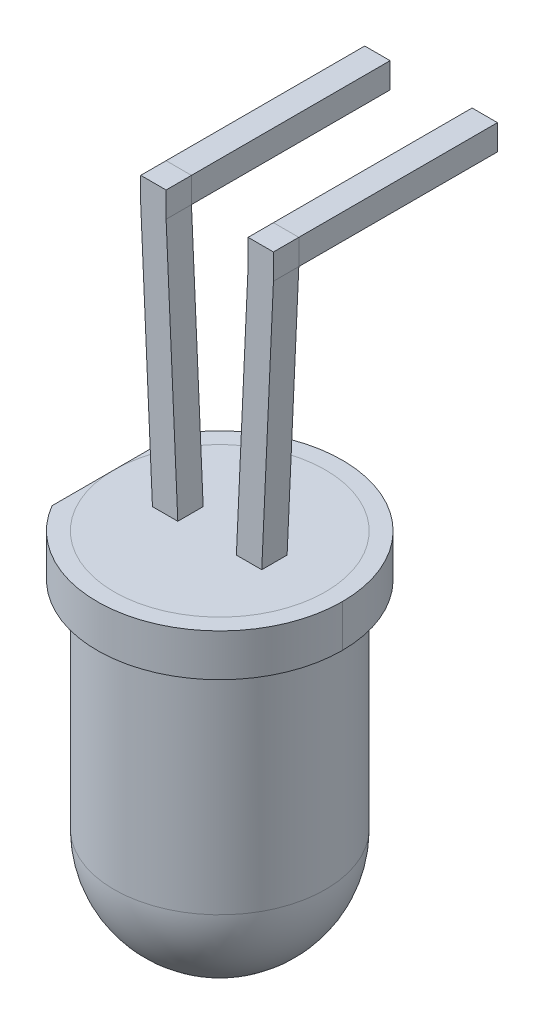
ISO-10303-21;
HEADER;
FILE_DESCRIPTION(('STEP AP214'),'2;1');
FILE_NAME('part.step','',(''),(''),'','','');
FILE_SCHEMA(('AUTOMOTIVE_DESIGN { 1 0 10303 214 1 1 1 1 }'));
ENDSEC;
DATA;
#1=APPLICATION_CONTEXT('core data for automotive mechanical design processes');
#2=APPLICATION_PROTOCOL_DEFINITION('international standard','automotive_design',2000,#1);
#3=PRODUCT_CONTEXT('',#1,'mechanical');
#4=PRODUCT('Part','Part','',(#3));
#5=PRODUCT_RELATED_PRODUCT_CATEGORY('part','',(#4));
#6=PRODUCT_DEFINITION_FORMATION('','',#4);
#7=PRODUCT_DEFINITION_CONTEXT('part definition',#1,'design');
#8=PRODUCT_DEFINITION('design','',#6,#7);
#9=PRODUCT_DEFINITION_SHAPE('','',#8);
#10=(LENGTH_UNIT() NAMED_UNIT(*) SI_UNIT(.MILLI.,.METRE.));
#11=(NAMED_UNIT(*) PLANE_ANGLE_UNIT() SI_UNIT($,.RADIAN.));
#12=(NAMED_UNIT(*) SI_UNIT($,.STERADIAN.) SOLID_ANGLE_UNIT());
#13=UNCERTAINTY_MEASURE_WITH_UNIT(LENGTH_MEASURE(1.E-05),#10,'distance_accuracy_value','');
#14=(GEOMETRIC_REPRESENTATION_CONTEXT(3) GLOBAL_UNCERTAINTY_ASSIGNED_CONTEXT((#13)) GLOBAL_UNIT_ASSIGNED_CONTEXT((#10,
#11,#12)) REPRESENTATION_CONTEXT('',''));
#15=CARTESIAN_POINT('',(0.,0.,0.));
#16=DIRECTION('',(0.,0.,1.));
#17=DIRECTION('',(1.,0.,0.));
#18=AXIS2_PLACEMENT_3D('',#15,#16,#17);
#19=CARTESIAN_POINT('',(2.84,0.3,-2.));
#20=DIRECTION('',(0.,0.,-1.));
#21=DIRECTION('',(0.,-1.,0.));
#22=AXIS2_PLACEMENT_3D('',#19,#20,#21);
#23=PLANE('',#22);
#24=DIRECTION('',(0.,1.,0.));
#25=VECTOR('',#24,1.);
#26=CARTESIAN_POINT('',(2.84,-0.3,-2.));
#27=LINE('',#26,#25);
#28=CARTESIAN_POINT('',(2.84,-0.3,-2.));
#29=VERTEX_POINT('',#28);
#30=CARTESIAN_POINT('',(2.84,0.3,-2.));
#31=VERTEX_POINT('',#30);
#32=EDGE_CURVE('E11',#29,#31,#27,.T.);
#33=ORIENTED_EDGE('',*,*,#32,.F.);
#34=DIRECTION('',(1.,0.,0.));
#35=VECTOR('',#34,1.);
#36=CARTESIAN_POINT('',(2.24,-0.3,-2.));
#37=LINE('',#36,#35);
#38=CARTESIAN_POINT('',(2.24,-0.3,-2.));
#39=VERTEX_POINT('',#38);
#40=EDGE_CURVE('E342',#39,#29,#37,.T.);
#41=ORIENTED_EDGE('',*,*,#40,.F.);
#42=DIRECTION('',(0.,-1.,0.));
#43=VECTOR('',#42,1.);
#44=CARTESIAN_POINT('',(2.24,0.3,-2.));
#45=LINE('',#44,#43);
#46=CARTESIAN_POINT('',(2.24,0.3,-2.));
#47=VERTEX_POINT('',#46);
#48=EDGE_CURVE('E26',#47,#39,#45,.T.);
#49=ORIENTED_EDGE('',*,*,#48,.F.);
#50=DIRECTION('',(-1.,0.,0.));
#51=VECTOR('',#50,1.);
#52=CARTESIAN_POINT('',(2.84,0.3,-2.));
#53=LINE('',#52,#51);
#54=EDGE_CURVE('E359',#31,#47,#53,.T.);
#55=ORIENTED_EDGE('',*,*,#54,.F.);
#56=EDGE_LOOP('',(#33,#41,#49,#55));
#57=FACE_BOUND('',#56,.T.);
#58=ADVANCED_FACE('F18',(#57),#23,.T.);
#59=CARTESIAN_POINT('',(2.84,-0.3,-2.));
#60=DIRECTION('',(-1.,0.,0.));
#61=DIRECTION('',(0.,0.,1.));
#62=AXIS2_PLACEMENT_3D('',#59,#60,#61);
#63=PLANE('',#62);
#64=ORIENTED_EDGE('',*,*,#32,.T.);
#65=DIRECTION('',(0.,0.,1.));
#66=VECTOR('',#65,1.);
#67=CARTESIAN_POINT('',(2.84,0.3,-2.));
#68=LINE('',#67,#66);
#69=CARTESIAN_POINT('',(2.84,0.3,2.7));
#70=VERTEX_POINT('',#69);
#71=EDGE_CURVE('E366',#31,#70,#68,.T.);
#72=ORIENTED_EDGE('',*,*,#71,.T.);
#73=DIRECTION('',(0.,-1.,0.));
#74=VECTOR('',#73,1.);
#75=CARTESIAN_POINT('',(2.84,0.3,2.7));
#76=LINE('',#75,#74);
#77=CARTESIAN_POINT('',(2.84,-0.3,2.7));
#78=VERTEX_POINT('',#77);
#79=EDGE_CURVE('E338',#70,#78,#76,.T.);
#80=ORIENTED_EDGE('',*,*,#79,.T.);
#81=DIRECTION('',(0.,0.,1.));
#82=VECTOR('',#81,1.);
#83=CARTESIAN_POINT('',(2.84,-0.3,-2.));
#84=LINE('',#83,#82);
#85=EDGE_CURVE('E346',#29,#78,#84,.T.);
#86=ORIENTED_EDGE('',*,*,#85,.F.);
#87=EDGE_LOOP('',(#64,#72,#80,#86));
#88=FACE_BOUND('',#87,.T.);
#89=ADVANCED_FACE('F378',(#88),#63,.F.);
#90=CARTESIAN_POINT('',(2.24,0.3,-2.));
#91=DIRECTION('',(1.,0.,0.));
#92=DIRECTION('',(0.,1.,0.));
#93=AXIS2_PLACEMENT_3D('',#90,#91,#92);
#94=PLANE('',#93);
#95=ORIENTED_EDGE('',*,*,#48,.T.);
#96=DIRECTION('',(0.,0.,1.));
#97=VECTOR('',#96,1.);
#98=CARTESIAN_POINT('',(2.24,-0.3,-2.));
#99=LINE('',#98,#97);
#100=CARTESIAN_POINT('',(2.24,-0.3,2.7));
#101=VERTEX_POINT('',#100);
#102=EDGE_CURVE('E349',#39,#101,#99,.T.);
#103=ORIENTED_EDGE('',*,*,#102,.T.);
#104=DIRECTION('',(0.,-1.,0.));
#105=VECTOR('',#104,1.);
#106=CARTESIAN_POINT('',(2.24,0.3,2.7));
#107=LINE('',#106,#105);
#108=CARTESIAN_POINT('',(2.24,0.3,2.7));
#109=VERTEX_POINT('',#108);
#110=EDGE_CURVE('E334',#109,#101,#107,.T.);
#111=ORIENTED_EDGE('',*,*,#110,.F.);
#112=DIRECTION('',(0.,0.,1.));
#113=VECTOR('',#112,1.);
#114=CARTESIAN_POINT('',(2.24,0.3,-2.));
#115=LINE('',#114,#113);
#116=EDGE_CURVE('E363',#47,#109,#115,.T.);
#117=ORIENTED_EDGE('',*,*,#116,.F.);
#118=EDGE_LOOP('',(#95,#103,#111,#117));
#119=FACE_BOUND('',#118,.T.);
#120=ADVANCED_FACE('F372',(#119),#94,.F.);
#121=CARTESIAN_POINT('',(2.84,0.3,-2.));
#122=DIRECTION('',(0.,-1.,0.));
#123=DIRECTION('',(0.,0.,-1.));
#124=AXIS2_PLACEMENT_3D('',#121,#122,#123);
#125=PLANE('',#124);
#126=ORIENTED_EDGE('',*,*,#54,.T.);
#127=ORIENTED_EDGE('',*,*,#116,.T.);
#128=DIRECTION('',(-1.,0.,0.));
#129=VECTOR('',#128,1.);
#130=CARTESIAN_POINT('',(2.84,0.3,2.7));
#131=LINE('',#130,#129);
#132=EDGE_CURVE('E301',#70,#109,#131,.T.);
#133=ORIENTED_EDGE('',*,*,#132,.F.);
#134=ORIENTED_EDGE('',*,*,#71,.F.);
#135=EDGE_LOOP('',(#126,#127,#133,#134));
#136=FACE_BOUND('',#135,.T.);
#137=ADVANCED_FACE('F537',(#136),#125,.F.);
#138=CARTESIAN_POINT('',(0.3,0.3,-2.));
#139=DIRECTION('',(0.,0.,-1.));
#140=DIRECTION('',(0.,-1.,0.));
#141=AXIS2_PLACEMENT_3D('',#138,#139,#140);
#142=PLANE('',#141);
#143=DIRECTION('',(0.,1.,0.));
#144=VECTOR('',#143,1.);
#145=CARTESIAN_POINT('',(0.3,-0.3,-2.));
#146=LINE('',#145,#144);
#147=CARTESIAN_POINT('',(0.3,-0.3,-2.));
#148=VERTEX_POINT('',#147);
#149=CARTESIAN_POINT('',(0.3,0.3,-2.));
#150=VERTEX_POINT('',#149);
#151=EDGE_CURVE('E356',#148,#150,#146,.T.);
#152=ORIENTED_EDGE('',*,*,#151,.F.);
#153=DIRECTION('',(1.,0.,0.));
#154=VECTOR('',#153,1.);
#155=CARTESIAN_POINT('',(-0.3,-0.3,-2.));
#156=LINE('',#155,#154);
#157=CARTESIAN_POINT('',(-0.3,-0.3,-2.));
#158=VERTEX_POINT('',#157);
#159=EDGE_CURVE('E232',#158,#148,#156,.T.);
#160=ORIENTED_EDGE('',*,*,#159,.F.);
#161=DIRECTION('',(0.,-1.,0.));
#162=VECTOR('',#161,1.);
#163=CARTESIAN_POINT('',(-0.3,0.3,-2.));
#164=LINE('',#163,#162);
#165=CARTESIAN_POINT('',(-0.3,0.3,-2.));
#166=VERTEX_POINT('',#165);
#167=EDGE_CURVE('E352',#166,#158,#164,.T.);
#168=ORIENTED_EDGE('',*,*,#167,.F.);
#169=DIRECTION('',(-1.,0.,0.));
#170=VECTOR('',#169,1.);
#171=CARTESIAN_POINT('',(0.3,0.3,-2.));
#172=LINE('',#171,#170);
#173=EDGE_CURVE('E355',#150,#166,#172,.T.);
#174=ORIENTED_EDGE('',*,*,#173,.F.);
#175=EDGE_LOOP('',(#152,#160,#168,#174));
#176=FACE_BOUND('',#175,.T.);
#177=ADVANCED_FACE('F509',(#176),#142,.T.);
#178=CARTESIAN_POINT('',(0.3,0.3,-2.));
#179=DIRECTION('',(0.,-1.,0.));
#180=DIRECTION('',(0.,0.,-1.));
#181=AXIS2_PLACEMENT_3D('',#178,#179,#180);
#182=PLANE('',#181);
#183=ORIENTED_EDGE('',*,*,#173,.T.);
#184=DIRECTION('',(0.,0.,1.));
#185=VECTOR('',#184,1.);
#186=CARTESIAN_POINT('',(-0.3,0.3,-2.));
#187=LINE('',#186,#185);
#188=CARTESIAN_POINT('',(-0.3,0.3,2.7));
#189=VERTEX_POINT('',#188);
#190=EDGE_CURVE('E447',#166,#189,#187,.T.);
#191=ORIENTED_EDGE('',*,*,#190,.T.);
#192=DIRECTION('',(-1.,0.,0.));
#193=VECTOR('',#192,1.);
#194=CARTESIAN_POINT('',(0.3,0.3,2.7));
#195=LINE('',#194,#193);
#196=CARTESIAN_POINT('',(0.3,0.3,2.7));
#197=VERTEX_POINT('',#196);
#198=EDGE_CURVE('E248',#197,#189,#195,.T.);
#199=ORIENTED_EDGE('',*,*,#198,.F.);
#200=DIRECTION('',(0.,0.,1.));
#201=VECTOR('',#200,1.);
#202=CARTESIAN_POINT('',(0.3,0.3,-2.));
#203=LINE('',#202,#201);
#204=EDGE_CURVE('E243',#150,#197,#203,.T.);
#205=ORIENTED_EDGE('',*,*,#204,.F.);
#206=EDGE_LOOP('',(#183,#191,#199,#205));
#207=FACE_BOUND('',#206,.T.);
#208=ADVANCED_FACE('F510',(#207),#182,.F.);
#209=CARTESIAN_POINT('',(0.3,-0.3,-2.));
#210=DIRECTION('',(-1.,0.,0.));
#211=DIRECTION('',(0.,0.,1.));
#212=AXIS2_PLACEMENT_3D('',#209,#210,#211);
#213=PLANE('',#212);
#214=ORIENTED_EDGE('',*,*,#151,.T.);
#215=ORIENTED_EDGE('',*,*,#204,.T.);
#216=DIRECTION('',(0.,-1.,0.));
#217=VECTOR('',#216,1.);
#218=CARTESIAN_POINT('',(0.3,0.3,2.7));
#219=LINE('',#218,#217);
#220=CARTESIAN_POINT('',(0.3,-0.3,2.7));
#221=VERTEX_POINT('',#220);
#222=EDGE_CURVE('E239',#197,#221,#219,.T.);
#223=ORIENTED_EDGE('',*,*,#222,.T.);
#224=DIRECTION('',(0.,0.,1.));
#225=VECTOR('',#224,1.);
#226=CARTESIAN_POINT('',(0.3,-0.3,-2.));
#227=LINE('',#226,#225);
#228=EDGE_CURVE('E224',#148,#221,#227,.T.);
#229=ORIENTED_EDGE('',*,*,#228,.F.);
#230=EDGE_LOOP('',(#214,#215,#223,#229));
#231=FACE_BOUND('',#230,.T.);
#232=ADVANCED_FACE('F241',(#231),#213,.F.);
#233=CARTESIAN_POINT('',(-0.3,0.3,-2.));
#234=DIRECTION('',(1.,0.,0.));
#235=DIRECTION('',(0.,1.,0.));
#236=AXIS2_PLACEMENT_3D('',#233,#234,#235);
#237=PLANE('',#236);
#238=ORIENTED_EDGE('',*,*,#167,.T.);
#239=DIRECTION('',(0.,0.,1.));
#240=VECTOR('',#239,1.);
#241=CARTESIAN_POINT('',(-0.3,-0.3,-2.));
#242=LINE('',#241,#240);
#243=CARTESIAN_POINT('',(-0.3,-0.3,2.7));
#244=VERTEX_POINT('',#243);
#245=EDGE_CURVE('E236',#158,#244,#242,.T.);
#246=ORIENTED_EDGE('',*,*,#245,.T.);
#247=DIRECTION('',(0.,-1.,0.));
#248=VECTOR('',#247,1.);
#249=CARTESIAN_POINT('',(-0.3,0.3,2.7));
#250=LINE('',#249,#248);
#251=EDGE_CURVE('E322',#189,#244,#250,.T.);
#252=ORIENTED_EDGE('',*,*,#251,.F.);
#253=ORIENTED_EDGE('',*,*,#190,.F.);
#254=EDGE_LOOP('',(#238,#246,#252,#253));
#255=FACE_BOUND('',#254,.T.);
#256=ADVANCED_FACE('F507',(#255),#237,.F.);
#257=CARTESIAN_POINT('',(2.24,-0.3,-2.));
#258=DIRECTION('',(0.,1.,0.));
#259=DIRECTION('',(1.,0.,0.));
#260=AXIS2_PLACEMENT_3D('',#257,#258,#259);
#261=PLANE('',#260);
#262=ORIENTED_EDGE('',*,*,#40,.T.);
#263=ORIENTED_EDGE('',*,*,#85,.T.);
#264=DIRECTION('',(1.,0.,0.));
#265=VECTOR('',#264,1.);
#266=CARTESIAN_POINT('',(2.24,-0.3,2.7));
#267=LINE('',#266,#265);
#268=EDGE_CURVE('E315',#101,#78,#267,.T.);
#269=ORIENTED_EDGE('',*,*,#268,.F.);
#270=ORIENTED_EDGE('',*,*,#102,.F.);
#271=EDGE_LOOP('',(#262,#263,#269,#270));
#272=FACE_BOUND('',#271,.T.);
#273=ADVANCED_FACE('F376',(#272),#261,.F.);
#274=CARTESIAN_POINT('',(2.84,0.3,2.7));
#275=DIRECTION('',(1.,0.,0.));
#276=DIRECTION('',(0.,1.,0.));
#277=AXIS2_PLACEMENT_3D('',#274,#275,#276);
#278=PLANE('',#277);
#279=DIRECTION('',(0.,0.,1.));
#280=VECTOR('',#279,1.);
#281=CARTESIAN_POINT('',(2.84,0.3,2.7));
#282=LINE('',#281,#280);
#283=CARTESIAN_POINT('',(2.84,0.3,3.3));
#284=VERTEX_POINT('',#283);
#285=EDGE_CURVE('E333',#70,#284,#282,.T.);
#286=ORIENTED_EDGE('',*,*,#285,.T.);
#287=DIRECTION('',(0.,-1.,0.));
#288=VECTOR('',#287,1.);
#289=CARTESIAN_POINT('',(2.84,0.3,3.3));
#290=LINE('',#289,#288);
#291=CARTESIAN_POINT('',(2.84,-0.3,3.3));
#292=VERTEX_POINT('',#291);
#293=EDGE_CURVE('E292',#284,#292,#290,.T.);
#294=ORIENTED_EDGE('',*,*,#293,.T.);
#295=DIRECTION('',(0.,0.,1.));
#296=VECTOR('',#295,1.);
#297=CARTESIAN_POINT('',(2.84,-0.3,2.7));
#298=LINE('',#297,#296);
#299=EDGE_CURVE('E308',#78,#292,#298,.T.);
#300=ORIENTED_EDGE('',*,*,#299,.F.);
#301=ORIENTED_EDGE('',*,*,#79,.F.);
#302=EDGE_LOOP('',(#286,#294,#300,#301));
#303=FACE_BOUND('',#302,.T.);
#304=ADVANCED_FACE('F389',(#303),#278,.T.);
#305=CARTESIAN_POINT('',(2.24,0.3,2.7));
#306=DIRECTION('',(1.,0.,0.));
#307=DIRECTION('',(0.,1.,0.));
#308=AXIS2_PLACEMENT_3D('',#305,#306,#307);
#309=PLANE('',#308);
#310=ORIENTED_EDGE('',*,*,#110,.T.);
#311=DIRECTION('',(0.,0.,1.));
#312=VECTOR('',#311,1.);
#313=CARTESIAN_POINT('',(2.24,-0.3,2.7));
#314=LINE('',#313,#312);
#315=CARTESIAN_POINT('',(2.24,-0.3,3.3));
#316=VERTEX_POINT('',#315);
#317=EDGE_CURVE('E309',#101,#316,#314,.T.);
#318=ORIENTED_EDGE('',*,*,#317,.T.);
#319=DIRECTION('',(0.,-1.,0.));
#320=VECTOR('',#319,1.);
#321=CARTESIAN_POINT('',(2.24,0.3,3.3));
#322=LINE('',#321,#320);
#323=CARTESIAN_POINT('',(2.24,0.3,3.3));
#324=VERTEX_POINT('',#323);
#325=EDGE_CURVE('E260',#324,#316,#322,.T.);
#326=ORIENTED_EDGE('',*,*,#325,.F.);
#327=DIRECTION('',(0.,0.,1.));
#328=VECTOR('',#327,1.);
#329=CARTESIAN_POINT('',(2.24,0.3,2.7));
#330=LINE('',#329,#328);
#331=EDGE_CURVE('E305',#109,#324,#330,.T.);
#332=ORIENTED_EDGE('',*,*,#331,.F.);
#333=EDGE_LOOP('',(#310,#318,#326,#332));
#334=FACE_BOUND('',#333,.T.);
#335=ADVANCED_FACE('F551',(#334),#309,.F.);
#336=CARTESIAN_POINT('',(2.84,0.3,2.7));
#337=DIRECTION('',(0.,-1.,0.));
#338=DIRECTION('',(0.,0.,-1.));
#339=AXIS2_PLACEMENT_3D('',#336,#337,#338);
#340=PLANE('',#339);
#341=ORIENTED_EDGE('',*,*,#132,.T.);
#342=ORIENTED_EDGE('',*,*,#331,.T.);
#343=DIRECTION('',(-1.,0.,0.));
#344=VECTOR('',#343,1.);
#345=CARTESIAN_POINT('',(2.84,0.3,3.3));
#346=LINE('',#345,#344);
#347=EDGE_CURVE('E296',#284,#324,#346,.T.);
#348=ORIENTED_EDGE('',*,*,#347,.F.);
#349=ORIENTED_EDGE('',*,*,#285,.F.);
#350=EDGE_LOOP('',(#341,#342,#348,#349));
#351=FACE_BOUND('',#350,.T.);
#352=ADVANCED_FACE('F554',(#351),#340,.F.);
#353=CARTESIAN_POINT('',(-0.3,-0.3,-2.));
#354=DIRECTION('',(0.,1.,0.));
#355=DIRECTION('',(1.,0.,0.));
#356=AXIS2_PLACEMENT_3D('',#353,#354,#355);
#357=PLANE('',#356);
#358=ORIENTED_EDGE('',*,*,#159,.T.);
#359=ORIENTED_EDGE('',*,*,#228,.T.);
#360=DIRECTION('',(1.,0.,0.));
#361=VECTOR('',#360,1.);
#362=CARTESIAN_POINT('',(-0.3,-0.3,2.7));
#363=LINE('',#362,#361);
#364=EDGE_CURVE('E229',#244,#221,#363,.T.);
#365=ORIENTED_EDGE('',*,*,#364,.F.);
#366=ORIENTED_EDGE('',*,*,#245,.F.);
#367=EDGE_LOOP('',(#358,#359,#365,#366));
#368=FACE_BOUND('',#367,.T.);
#369=ADVANCED_FACE('F226',(#368),#357,.F.);
#370=CARTESIAN_POINT('',(0.3,0.3,2.7));
#371=DIRECTION('',(0.,-1.,0.));
#372=DIRECTION('',(0.,0.,-1.));
#373=AXIS2_PLACEMENT_3D('',#370,#371,#372);
#374=PLANE('',#373);
#375=ORIENTED_EDGE('',*,*,#198,.T.);
#376=DIRECTION('',(0.,0.,1.));
#377=VECTOR('',#376,1.);
#378=CARTESIAN_POINT('',(-0.3,0.3,2.7));
#379=LINE('',#378,#377);
#380=CARTESIAN_POINT('',(-0.3,0.3,3.3));
#381=VERTEX_POINT('',#380);
#382=EDGE_CURVE('E325',#189,#381,#379,.T.);
#383=ORIENTED_EDGE('',*,*,#382,.T.);
#384=DIRECTION('',(-1.,0.,0.));
#385=VECTOR('',#384,1.);
#386=CARTESIAN_POINT('',(0.3,0.3,3.3));
#387=LINE('',#386,#385);
#388=CARTESIAN_POINT('',(0.3,0.3,3.3));
#389=VERTEX_POINT('',#388);
#390=EDGE_CURVE('E442',#389,#381,#387,.T.);
#391=ORIENTED_EDGE('',*,*,#390,.F.);
#392=DIRECTION('',(0.,0.,1.));
#393=VECTOR('',#392,1.);
#394=CARTESIAN_POINT('',(0.3,0.3,2.7));
#395=LINE('',#394,#393);
#396=EDGE_CURVE('E249',#197,#389,#395,.T.);
#397=ORIENTED_EDGE('',*,*,#396,.F.);
#398=EDGE_LOOP('',(#375,#383,#391,#397));
#399=FACE_BOUND('',#398,.T.);
#400=ADVANCED_FACE('F512',(#399),#374,.F.);
#401=CARTESIAN_POINT('',(0.3,0.3,2.7));
#402=DIRECTION('',(1.,0.,0.));
#403=DIRECTION('',(0.,1.,0.));
#404=AXIS2_PLACEMENT_3D('',#401,#402,#403);
#405=PLANE('',#404);
#406=ORIENTED_EDGE('',*,*,#396,.T.);
#407=DIRECTION('',(0.,-1.,0.));
#408=VECTOR('',#407,1.);
#409=CARTESIAN_POINT('',(0.3,0.3,3.3));
#410=LINE('',#409,#408);
#411=CARTESIAN_POINT('',(0.3,-0.3,3.3));
#412=VERTEX_POINT('',#411);
#413=EDGE_CURVE('E256',#389,#412,#410,.T.);
#414=ORIENTED_EDGE('',*,*,#413,.T.);
#415=DIRECTION('',(0.,0.,1.));
#416=VECTOR('',#415,1.);
#417=CARTESIAN_POINT('',(0.3,-0.3,2.7));
#418=LINE('',#417,#416);
#419=EDGE_CURVE('E252',#221,#412,#418,.T.);
#420=ORIENTED_EDGE('',*,*,#419,.F.);
#421=ORIENTED_EDGE('',*,*,#222,.F.);
#422=EDGE_LOOP('',(#406,#414,#420,#421));
#423=FACE_BOUND('',#422,.T.);
#424=ADVANCED_FACE('F254',(#423),#405,.T.);
#425=CARTESIAN_POINT('',(-0.3,0.3,2.7));
#426=DIRECTION('',(1.,0.,0.));
#427=DIRECTION('',(0.,1.,0.));
#428=AXIS2_PLACEMENT_3D('',#425,#426,#427);
#429=PLANE('',#428);
#430=ORIENTED_EDGE('',*,*,#251,.T.);
#431=DIRECTION('',(0.,0.,1.));
#432=VECTOR('',#431,1.);
#433=CARTESIAN_POINT('',(-0.3,-0.3,2.7));
#434=LINE('',#433,#432);
#435=CARTESIAN_POINT('',(-0.3,-0.3,3.3));
#436=VERTEX_POINT('',#435);
#437=EDGE_CURVE('E434',#244,#436,#434,.T.);
#438=ORIENTED_EDGE('',*,*,#437,.T.);
#439=DIRECTION('',(0.,-1.,0.));
#440=VECTOR('',#439,1.);
#441=CARTESIAN_POINT('',(-0.3,0.3,3.3));
#442=LINE('',#441,#440);
#443=EDGE_CURVE('E281',#381,#436,#442,.T.);
#444=ORIENTED_EDGE('',*,*,#443,.F.);
#445=ORIENTED_EDGE('',*,*,#382,.F.);
#446=EDGE_LOOP('',(#430,#438,#444,#445));
#447=FACE_BOUND('',#446,.T.);
#448=ADVANCED_FACE('F504',(#447),#429,.F.);
#449=CARTESIAN_POINT('',(1.27,-12.45,3.));
#450=DIRECTION('',(0.,-1.,0.));
#451=DIRECTION('',(0.,0.,1.));
#452=AXIS2_PLACEMENT_3D('',#449,#450,#451);
#453=SPHERICAL_SURFACE('',#452,2.5);
#454=CARTESIAN_POINT('',(1.27,-12.45,3.));
#455=DIRECTION('',(1.,0.,0.));
#456=DIRECTION('',(0.,1.,0.));
#457=AXIS2_PLACEMENT_3D('',#454,#455,#456);
#458=CIRCLE('',#457,2.5);
#459=CARTESIAN_POINT('',(1.27,-12.45,5.5));
#460=VERTEX_POINT('',#459);
#461=CARTESIAN_POINT('',(1.27,-14.95,3.));
#462=VERTEX_POINT('',#461);
#463=EDGE_CURVE('E319',#460,#462,#458,.T.);
#464=ORIENTED_EDGE('',*,*,#463,.T.);
#465=ORIENTED_EDGE('',*,*,#463,.F.);
#466=CARTESIAN_POINT('',(1.27,-12.45,3.));
#467=DIRECTION('',(0.,1.,0.));
#468=DIRECTION('',(0.,0.,1.));
#469=AXIS2_PLACEMENT_3D('',#466,#467,#468);
#470=CIRCLE('',#469,2.5);
#471=EDGE_CURVE('E427',#460,#460,#470,.T.);
#472=ORIENTED_EDGE('',*,*,#471,.F.);
#473=EDGE_LOOP('',(#464,#465,#472));
#474=FACE_BOUND('',#473,.T.);
#475=ADVANCED_FACE('F567',(#474),#453,.T.);
#476=CARTESIAN_POINT('',(2.84,0.3,2.7));
#477=DIRECTION('',(0.,0.,-1.));
#478=DIRECTION('',(0.,-1.,0.));
#479=AXIS2_PLACEMENT_3D('',#476,#477,#478);
#480=PLANE('',#479);
#481=DIRECTION('',(-0.0457535614099251,-0.998952757450675,0.));
#482=VECTOR('',#481,1.);
#483=CARTESIAN_POINT('',(2.24,-0.3,2.7));
#484=LINE('',#483,#482);
#485=CARTESIAN_POINT('',(1.962900763359,-6.35,2.7));
#486=VERTEX_POINT('',#485);
#487=EDGE_CURVE('E312',#101,#486,#484,.T.);
#488=ORIENTED_EDGE('',*,*,#487,.F.);
#489=ORIENTED_EDGE('',*,*,#268,.T.);
#490=DIRECTION('',(-0.0457535614099251,-0.998952757450675,0.));
#491=VECTOR('',#490,1.);
#492=CARTESIAN_POINT('',(2.84,-0.3,2.7));
#493=LINE('',#492,#491);
#494=CARTESIAN_POINT('',(2.562900763359,-6.35,2.7));
#495=VERTEX_POINT('',#494);
#496=EDGE_CURVE('E300',#78,#495,#493,.T.);
#497=ORIENTED_EDGE('',*,*,#496,.T.);
#498=DIRECTION('',(-1.,0.,0.));
#499=VECTOR('',#498,1.);
#500=CARTESIAN_POINT('',(2.055,-6.35,2.7));
#501=LINE('',#500,#499);
#502=EDGE_CURVE('E404',#495,#486,#501,.T.);
#503=ORIENTED_EDGE('',*,*,#502,.T.);
#504=EDGE_LOOP('',(#488,#489,#497,#503));
#505=FACE_BOUND('',#504,.T.);
#506=ADVANCED_FACE('F384',(#505),#480,.T.);
#507=CARTESIAN_POINT('',(2.24,-0.3,2.7));
#508=DIRECTION('',(0.998952757450675,-0.0457535614099251,0.));
#509=DIRECTION('',(0.,0.,-1.));
#510=AXIS2_PLACEMENT_3D('',#507,#508,#509);
#511=PLANE('',#510);
#512=DIRECTION('',(0.,0.,-1.));
#513=VECTOR('',#512,1.);
#514=CARTESIAN_POINT('',(1.962900763359,-6.35,2.85));
#515=LINE('',#514,#513);
#516=CARTESIAN_POINT('',(1.962900763359,-6.35,3.3));
#517=VERTEX_POINT('',#516);
#518=EDGE_CURVE('E410',#517,#486,#515,.T.);
#519=ORIENTED_EDGE('',*,*,#518,.F.);
#520=DIRECTION('',(-0.0457535614099251,-0.998952757450675,0.));
#521=VECTOR('',#520,1.);
#522=CARTESIAN_POINT('',(2.24,-0.3,3.3));
#523=LINE('',#522,#521);
#524=EDGE_CURVE('E288',#316,#517,#523,.T.);
#525=ORIENTED_EDGE('',*,*,#524,.F.);
#526=ORIENTED_EDGE('',*,*,#317,.F.);
#527=ORIENTED_EDGE('',*,*,#487,.T.);
#528=EDGE_LOOP('',(#519,#525,#526,#527));
#529=FACE_BOUND('',#528,.T.);
#530=ADVANCED_FACE('F573',(#529),#511,.F.);
#531=CARTESIAN_POINT('',(2.84,-0.3,2.7));
#532=DIRECTION('',(0.998952757450675,-0.0457535614099251,0.));
#533=DIRECTION('',(0.,0.,-1.));
#534=AXIS2_PLACEMENT_3D('',#531,#532,#533);
#535=PLANE('',#534);
#536=ORIENTED_EDGE('',*,*,#496,.F.);
#537=ORIENTED_EDGE('',*,*,#299,.T.);
#538=DIRECTION('',(-0.0457535614099251,-0.998952757450675,0.));
#539=VECTOR('',#538,1.);
#540=CARTESIAN_POINT('',(2.84,-0.3,3.3));
#541=LINE('',#540,#539);
#542=CARTESIAN_POINT('',(2.562900763359,-6.35,3.3));
#543=VERTEX_POINT('',#542);
#544=EDGE_CURVE('E289',#292,#543,#541,.T.);
#545=ORIENTED_EDGE('',*,*,#544,.T.);
#546=DIRECTION('',(0.,0.,-1.));
#547=VECTOR('',#546,1.);
#548=CARTESIAN_POINT('',(2.562900763359,-6.35,2.85));
#549=LINE('',#548,#547);
#550=EDGE_CURVE('E397',#543,#495,#549,.T.);
#551=ORIENTED_EDGE('',*,*,#550,.T.);
#552=EDGE_LOOP('',(#536,#537,#545,#551));
#553=FACE_BOUND('',#552,.T.);
#554=ADVANCED_FACE('F395',(#553),#535,.T.);
#555=CARTESIAN_POINT('',(2.84,0.3,3.3));
#556=DIRECTION('',(0.,0.,-1.));
#557=DIRECTION('',(0.,-1.,0.));
#558=AXIS2_PLACEMENT_3D('',#555,#556,#557);
#559=PLANE('',#558);
#560=ORIENTED_EDGE('',*,*,#325,.T.);
#561=ORIENTED_EDGE('',*,*,#524,.T.);
#562=DIRECTION('',(-1.,0.,0.));
#563=VECTOR('',#562,1.);
#564=CARTESIAN_POINT('',(2.055,-6.35,3.3));
#565=LINE('',#564,#563);
#566=EDGE_CURVE('E403',#543,#517,#565,.T.);
#567=ORIENTED_EDGE('',*,*,#566,.F.);
#568=ORIENTED_EDGE('',*,*,#544,.F.);
#569=ORIENTED_EDGE('',*,*,#293,.F.);
#570=ORIENTED_EDGE('',*,*,#347,.T.);
#571=EDGE_LOOP('',(#560,#561,#567,#568,#569,#570));
#572=FACE_BOUND('',#571,.T.);
#573=ADVANCED_FACE('F578',(#572),#559,.F.);
#574=CARTESIAN_POINT('',(0.3,-0.3,2.7));
#575=DIRECTION('',(0.998952757450675,0.0457535614099251,0.));
#576=DIRECTION('',(0.,0.,-1.));
#577=AXIS2_PLACEMENT_3D('',#574,#575,#576);
#578=PLANE('',#577);
#579=DIRECTION('',(0.0457535614099251,-0.998952757450675,0.));
#580=VECTOR('',#579,1.);
#581=CARTESIAN_POINT('',(0.3,-0.3,2.7));
#582=LINE('',#581,#580);
#583=CARTESIAN_POINT('',(0.577099236641,-6.35,2.7));
#584=VERTEX_POINT('',#583);
#585=EDGE_CURVE('E261',#221,#584,#582,.T.);
#586=ORIENTED_EDGE('',*,*,#585,.F.);
#587=ORIENTED_EDGE('',*,*,#419,.T.);
#588=DIRECTION('',(0.0457535614099251,-0.998952757450675,0.));
#589=VECTOR('',#588,1.);
#590=CARTESIAN_POINT('',(0.3,-0.3,3.3));
#591=LINE('',#590,#589);
#592=CARTESIAN_POINT('',(0.577099236641,-6.35,3.3));
#593=VERTEX_POINT('',#592);
#594=EDGE_CURVE('E276',#412,#593,#591,.T.);
#595=ORIENTED_EDGE('',*,*,#594,.T.);
#596=DIRECTION('',(0.,0.,-1.));
#597=VECTOR('',#596,1.);
#598=CARTESIAN_POINT('',(0.577099236641,-6.35,2.85));
#599=LINE('',#598,#597);
#600=EDGE_CURVE('E266',#593,#584,#599,.T.);
#601=ORIENTED_EDGE('',*,*,#600,.T.);
#602=EDGE_LOOP('',(#586,#587,#595,#601));
#603=FACE_BOUND('',#602,.T.);
#604=ADVANCED_FACE('F264',(#603),#578,.T.);
#605=CARTESIAN_POINT('',(0.3,0.3,2.7));
#606=DIRECTION('',(0.,0.,1.));
#607=DIRECTION('',(1.,0.,0.));
#608=AXIS2_PLACEMENT_3D('',#605,#606,#607);
#609=PLANE('',#608);
#610=DIRECTION('',(1.,0.,0.));
#611=VECTOR('',#610,1.);
#612=CARTESIAN_POINT('',(0.785,-6.35,2.7));
#613=LINE('',#612,#611);
#614=CARTESIAN_POINT('',(-0.02290076335878,-6.35,2.7));
#615=VERTEX_POINT('',#614);
#616=EDGE_CURVE('E482',#615,#584,#613,.T.);
#617=ORIENTED_EDGE('',*,*,#616,.F.);
#618=DIRECTION('',(0.0457535614099251,-0.998952757450675,0.));
#619=VECTOR('',#618,1.);
#620=CARTESIAN_POINT('',(-0.3,-0.3,2.7));
#621=LINE('',#620,#619);
#622=EDGE_CURVE('E273',#244,#615,#621,.T.);
#623=ORIENTED_EDGE('',*,*,#622,.F.);
#624=ORIENTED_EDGE('',*,*,#364,.T.);
#625=ORIENTED_EDGE('',*,*,#585,.T.);
#626=EDGE_LOOP('',(#617,#623,#624,#625));
#627=FACE_BOUND('',#626,.T.);
#628=ADVANCED_FACE('F272',(#627),#609,.F.);
#629=CARTESIAN_POINT('',(0.3,0.3,3.3));
#630=DIRECTION('',(0.,0.,1.));
#631=DIRECTION('',(1.,0.,0.));
#632=AXIS2_PLACEMENT_3D('',#629,#630,#631);
#633=PLANE('',#632);
#634=ORIENTED_EDGE('',*,*,#413,.F.);
#635=ORIENTED_EDGE('',*,*,#390,.T.);
#636=ORIENTED_EDGE('',*,*,#443,.T.);
#637=DIRECTION('',(0.0457535614099251,-0.998952757450675,0.));
#638=VECTOR('',#637,1.);
#639=CARTESIAN_POINT('',(-0.3,-0.3,3.3));
#640=LINE('',#639,#638);
#641=CARTESIAN_POINT('',(-0.02290076335878,-6.35,3.3));
#642=VERTEX_POINT('',#641);
#643=EDGE_CURVE('E431',#436,#642,#640,.T.);
#644=ORIENTED_EDGE('',*,*,#643,.T.);
#645=DIRECTION('',(1.,0.,0.));
#646=VECTOR('',#645,1.);
#647=CARTESIAN_POINT('',(0.785,-6.35,3.3));
#648=LINE('',#647,#646);
#649=EDGE_CURVE('E487',#642,#593,#648,.T.);
#650=ORIENTED_EDGE('',*,*,#649,.T.);
#651=ORIENTED_EDGE('',*,*,#594,.F.);
#652=EDGE_LOOP('',(#634,#635,#636,#644,#650,#651));
#653=FACE_BOUND('',#652,.T.);
#654=ADVANCED_FACE('F515',(#653),#633,.T.);
#655=CARTESIAN_POINT('',(-0.3,-0.3,2.7));
#656=DIRECTION('',(0.998952757450675,0.0457535614099251,0.));
#657=DIRECTION('',(0.,0.,-1.));
#658=AXIS2_PLACEMENT_3D('',#655,#656,#657);
#659=PLANE('',#658);
#660=DIRECTION('',(0.,0.,-1.));
#661=VECTOR('',#660,1.);
#662=CARTESIAN_POINT('',(-0.02290076335878,-6.35,2.85));
#663=LINE('',#662,#661);
#664=EDGE_CURVE('E415',#642,#615,#663,.T.);
#665=ORIENTED_EDGE('',*,*,#664,.F.);
#666=ORIENTED_EDGE('',*,*,#643,.F.);
#667=ORIENTED_EDGE('',*,*,#437,.F.);
#668=ORIENTED_EDGE('',*,*,#622,.T.);
#669=EDGE_LOOP('',(#665,#666,#667,#668));
#670=FACE_BOUND('',#669,.T.);
#671=ADVANCED_FACE('F501',(#670),#659,.F.);
#672=CARTESIAN_POINT('',(1.27,-6.35,3.));
#673=DIRECTION('',(0.,-1.,0.));
#674=DIRECTION('',(0.,0.,1.));
#675=AXIS2_PLACEMENT_3D('',#672,#673,#674);
#676=CYLINDRICAL_SURFACE('',#675,2.5);
#677=DIRECTION('',(0.,-1.,0.));
#678=VECTOR('',#677,1.);
#679=CARTESIAN_POINT('',(1.27,-6.35,5.5));
#680=LINE('',#679,#678);
#681=CARTESIAN_POINT('',(1.27,-7.35,5.5));
#682=VERTEX_POINT('',#681);
#683=EDGE_CURVE('E423',#682,#460,#680,.T.);
#684=ORIENTED_EDGE('',*,*,#683,.T.);
#685=ORIENTED_EDGE('',*,*,#471,.T.);
#686=ORIENTED_EDGE('',*,*,#683,.F.);
#687=CARTESIAN_POINT('',(1.27,-7.35,3.));
#688=DIRECTION('',(0.,-1.,0.));
#689=DIRECTION('',(1.,0.,0.));
#690=AXIS2_PLACEMENT_3D('',#687,#688,#689);
#691=CIRCLE('',#690,2.5);
#692=CARTESIAN_POINT('',(-1.23,-7.35,3.));
#693=VERTEX_POINT('',#692);
#694=EDGE_CURVE('E464',#682,#693,#691,.T.);
#695=ORIENTED_EDGE('',*,*,#694,.T.);
#696=CARTESIAN_POINT('',(1.27,-7.35,3.));
#697=DIRECTION('',(0.,-1.,0.));
#698=DIRECTION('',(1.,0.,0.));
#699=AXIS2_PLACEMENT_3D('',#696,#697,#698);
#700=CIRCLE('',#699,2.5);
#701=CARTESIAN_POINT('',(3.77,-7.35,3.));
#702=VERTEX_POINT('',#701);
#703=EDGE_CURVE('E473',#693,#702,#700,.T.);
#704=ORIENTED_EDGE('',*,*,#703,.T.);
#705=CARTESIAN_POINT('',(1.27,-7.35,3.));
#706=DIRECTION('',(0.,-1.,0.));
#707=DIRECTION('',(1.,0.,0.));
#708=AXIS2_PLACEMENT_3D('',#705,#706,#707);
#709=CIRCLE('',#708,2.5);
#710=EDGE_CURVE('E468',#702,#682,#709,.T.);
#711=ORIENTED_EDGE('',*,*,#710,.T.);
#712=EDGE_LOOP('',(#684,#685,#686,#695,#704,#711));
#713=FACE_BOUND('',#712,.T.);
#714=ADVANCED_FACE('F524',(#713),#676,.T.);
#715=CARTESIAN_POINT('',(1.27,-6.35,3.));
#716=DIRECTION('',(0.,1.,0.));
#717=DIRECTION('',(1.,0.,0.));
#718=AXIS2_PLACEMENT_3D('',#715,#716,#717);
#719=PLANE('',#718);
#720=ORIENTED_EDGE('',*,*,#518,.T.);
#721=ORIENTED_EDGE('',*,*,#502,.F.);
#722=ORIENTED_EDGE('',*,*,#550,.F.);
#723=ORIENTED_EDGE('',*,*,#566,.T.);
#724=EDGE_LOOP('',(#720,#721,#722,#723));
#725=FACE_BOUND('',#724,.T.);
#726=ORIENTED_EDGE('',*,*,#616,.T.);
#727=ORIENTED_EDGE('',*,*,#600,.F.);
#728=ORIENTED_EDGE('',*,*,#649,.F.);
#729=ORIENTED_EDGE('',*,*,#664,.T.);
#730=EDGE_LOOP('',(#726,#727,#728,#729));
#731=FACE_BOUND('',#730,.T.);
#732=CARTESIAN_POINT('',(1.27,-6.35,3.));
#733=DIRECTION('',(0.,-1.,0.));
#734=DIRECTION('',(1.,0.,0.));
#735=AXIS2_PLACEMENT_3D('',#732,#733,#734);
#736=CIRCLE('',#735,2.5);
#737=CARTESIAN_POINT('',(-1.23,-6.35,3.));
#738=VERTEX_POINT('',#737);
#739=CARTESIAN_POINT('',(3.77,-6.35,3.));
#740=VERTEX_POINT('',#739);
#741=EDGE_CURVE('E1060',#738,#740,#736,.T.);
#742=ORIENTED_EDGE('',*,*,#741,.F.);
#743=CARTESIAN_POINT('',(1.27,-6.35,3.));
#744=DIRECTION('',(0.,-1.,0.));
#745=DIRECTION('',(1.,0.,0.));
#746=AXIS2_PLACEMENT_3D('',#743,#744,#745);
#747=CIRCLE('',#746,2.5);
#748=CARTESIAN_POINT('',(1.27,-6.35,5.5));
#749=VERTEX_POINT('',#748);
#750=EDGE_CURVE('E1051',#749,#738,#747,.T.);
#751=ORIENTED_EDGE('',*,*,#750,.F.);
#752=CARTESIAN_POINT('',(1.27,-6.35,3.));
#753=DIRECTION('',(0.,-1.,0.));
#754=DIRECTION('',(1.,0.,0.));
#755=AXIS2_PLACEMENT_3D('',#752,#753,#754);
#756=CIRCLE('',#755,2.5);
#757=EDGE_CURVE('E1057',#740,#749,#756,.T.);
#758=ORIENTED_EDGE('',*,*,#757,.F.);
#759=EDGE_LOOP('',(#742,#751,#758));
#760=FACE_BOUND('',#759,.T.);
#761=ADVANCED_FACE('F407',(#725,#731,#760),#719,.T.);
#762=CARTESIAN_POINT('',(-1.23,-7.35,5.9));
#763=DIRECTION('',(-1.,0.,0.));
#764=DIRECTION('',(0.,1.,0.));
#765=AXIS2_PLACEMENT_3D('',#762,#763,#764);
#766=PLANE('',#765);
#767=DIRECTION('',(0.,0.,-1.));
#768=VECTOR('',#767,1.);
#769=CARTESIAN_POINT('',(-1.23,-7.35,5.9));
#770=LINE('',#769,#768);
#771=CARTESIAN_POINT('',(-1.23,-7.35,1.53030615433));
#772=VERTEX_POINT('',#771);
#773=EDGE_CURVE('E462',#693,#772,#770,.T.);
#774=ORIENTED_EDGE('',*,*,#773,.F.);
#775=DIRECTION('',(0.,1.,0.));
#776=VECTOR('',#775,1.);
#777=CARTESIAN_POINT('',(-1.23,-6.35,3.));
#778=LINE('',#777,#776);
#779=EDGE_CURVE('E469',#693,#738,#778,.T.);
#780=ORIENTED_EDGE('',*,*,#779,.T.);
#781=DIRECTION('',(0.,0.,1.));
#782=VECTOR('',#781,1.);
#783=CARTESIAN_POINT('',(-1.23,-6.35,4.45));
#784=LINE('',#783,#782);
#785=CARTESIAN_POINT('',(-1.23,-6.35,1.53030615433));
#786=VERTEX_POINT('',#785);
#787=EDGE_CURVE('E1065',#786,#738,#784,.T.);
#788=ORIENTED_EDGE('',*,*,#787,.F.);
#789=DIRECTION('',(0.,1.,0.));
#790=VECTOR('',#789,1.);
#791=CARTESIAN_POINT('',(-1.23,-6.35,1.53030615433));
#792=LINE('',#791,#790);
#793=EDGE_CURVE('E479',#772,#786,#792,.T.);
#794=ORIENTED_EDGE('',*,*,#793,.F.);
#795=EDGE_LOOP('',(#774,#780,#788,#794));
#796=FACE_BOUND('',#795,.T.);
#797=ADVANCED_FACE('F598',(#796),#766,.T.);
#798=CARTESIAN_POINT('',(1.27,-6.35,3.));
#799=DIRECTION('',(0.,1.,0.));
#800=DIRECTION('',(1.,0.,0.));
#801=AXIS2_PLACEMENT_3D('',#798,#799,#800);
#802=CYLINDRICAL_SURFACE('',#801,2.9);
#803=CARTESIAN_POINT('',(1.27,-7.35,3.));
#804=DIRECTION('',(0.,-1.,0.));
#805=DIRECTION('',(1.,0.,0.));
#806=AXIS2_PLACEMENT_3D('',#803,#804,#805);
#807=CIRCLE('',#806,2.9);
#808=CARTESIAN_POINT('',(4.17,-7.35,3.));
#809=VERTEX_POINT('',#808);
#810=EDGE_CURVE('E476',#772,#809,#807,.T.);
#811=ORIENTED_EDGE('',*,*,#810,.F.);
#812=ORIENTED_EDGE('',*,*,#793,.T.);
#813=CARTESIAN_POINT('',(1.27,-6.35,3.));
#814=DIRECTION('',(0.,-1.,0.));
#815=DIRECTION('',(1.,0.,0.));
#816=AXIS2_PLACEMENT_3D('',#813,#814,#815);
#817=CIRCLE('',#816,2.9);
#818=CARTESIAN_POINT('',(4.17,-6.35,3.));
#819=VERTEX_POINT('',#818);
#820=EDGE_CURVE('E1071',#786,#819,#817,.T.);
#821=ORIENTED_EDGE('',*,*,#820,.T.);
#822=DIRECTION('',(0.,-1.,0.));
#823=VECTOR('',#822,1.);
#824=CARTESIAN_POINT('',(4.17,-6.35,3.));
#825=LINE('',#824,#823);
#826=EDGE_CURVE('E1096',#819,#809,#825,.T.);
#827=ORIENTED_EDGE('',*,*,#826,.T.);
#828=EDGE_LOOP('',(#811,#812,#821,#827));
#829=FACE_BOUND('',#828,.T.);
#830=ADVANCED_FACE('F594',(#829),#802,.T.);
#831=CARTESIAN_POINT('',(4.17,-7.35,3.));
#832=DIRECTION('',(0.,1.,0.));
#833=DIRECTION('',(0.,0.,-1.));
#834=AXIS2_PLACEMENT_3D('',#831,#832,#833);
#835=PLANE('',#834);
#836=DIRECTION('',(0.,0.,-1.));
#837=VECTOR('',#836,1.);
#838=CARTESIAN_POINT('',(-1.23,-7.35,5.9));
#839=LINE('',#838,#837);
#840=CARTESIAN_POINT('',(-1.23,-7.35,4.46969384567));
#841=VERTEX_POINT('',#840);
#842=EDGE_CURVE('E1050',#841,#693,#839,.T.);
#843=ORIENTED_EDGE('',*,*,#842,.T.);
#844=ORIENTED_EDGE('',*,*,#694,.F.);
#845=ORIENTED_EDGE('',*,*,#710,.F.);
#846=ORIENTED_EDGE('',*,*,#703,.F.);
#847=ORIENTED_EDGE('',*,*,#773,.T.);
#848=ORIENTED_EDGE('',*,*,#810,.T.);
#849=CARTESIAN_POINT('',(1.27,-7.35,3.));
#850=DIRECTION('',(0.,-1.,0.));
#851=DIRECTION('',(1.,0.,0.));
#852=AXIS2_PLACEMENT_3D('',#849,#850,#851);
#853=CIRCLE('',#852,2.9);
#854=EDGE_CURVE('E1111',#809,#841,#853,.T.);
#855=ORIENTED_EDGE('',*,*,#854,.T.);
#856=EDGE_LOOP('',(#843,#844,#845,#846,#847,#848,#855));
#857=FACE_BOUND('',#856,.T.);
#858=ADVANCED_FACE('F597',(#857),#835,.F.);
#859=CARTESIAN_POINT('',(-1.23,-7.35,5.9));
#860=DIRECTION('',(-1.,0.,0.));
#861=DIRECTION('',(0.,1.,0.));
#862=AXIS2_PLACEMENT_3D('',#859,#860,#861);
#863=PLANE('',#862);
#864=ORIENTED_EDGE('',*,*,#842,.F.);
#865=DIRECTION('',(0.,1.,0.));
#866=VECTOR('',#865,1.);
#867=CARTESIAN_POINT('',(-1.23,-6.35,4.46969384567));
#868=LINE('',#867,#866);
#869=CARTESIAN_POINT('',(-1.23,-6.35,4.46969384567));
#870=VERTEX_POINT('',#869);
#871=EDGE_CURVE('E1117',#841,#870,#868,.T.);
#872=ORIENTED_EDGE('',*,*,#871,.T.);
#873=DIRECTION('',(0.,0.,1.));
#874=VECTOR('',#873,1.);
#875=CARTESIAN_POINT('',(-1.23,-6.35,4.45));
#876=LINE('',#875,#874);
#877=EDGE_CURVE('E1046',#738,#870,#876,.T.);
#878=ORIENTED_EDGE('',*,*,#877,.F.);
#879=ORIENTED_EDGE('',*,*,#779,.F.);
#880=EDGE_LOOP('',(#864,#872,#878,#879));
#881=FACE_BOUND('',#880,.T.);
#882=ADVANCED_FACE('F591',(#881),#863,.T.);
#883=CARTESIAN_POINT('',(4.17,-6.35,3.));
#884=DIRECTION('',(0.,1.,0.));
#885=DIRECTION('',(0.,0.,-1.));
#886=AXIS2_PLACEMENT_3D('',#883,#884,#885);
#887=PLANE('',#886);
#888=CARTESIAN_POINT('',(1.27,-6.35,3.));
#889=DIRECTION('',(0.,-1.,0.));
#890=DIRECTION('',(1.,0.,0.));
#891=AXIS2_PLACEMENT_3D('',#888,#889,#890);
#892=CIRCLE('',#891,2.9);
#893=EDGE_CURVE('E1083',#819,#870,#892,.T.);
#894=ORIENTED_EDGE('',*,*,#893,.F.);
#895=ORIENTED_EDGE('',*,*,#820,.F.);
#896=ORIENTED_EDGE('',*,*,#787,.T.);
#897=ORIENTED_EDGE('',*,*,#741,.T.);
#898=ORIENTED_EDGE('',*,*,#757,.T.);
#899=ORIENTED_EDGE('',*,*,#750,.T.);
#900=ORIENTED_EDGE('',*,*,#877,.T.);
#901=EDGE_LOOP('',(#894,#895,#896,#897,#898,#899,#900));
#902=FACE_BOUND('',#901,.T.);
#903=ADVANCED_FACE('F692',(#902),#887,.T.);
#904=CARTESIAN_POINT('',(1.27,-6.35,3.));
#905=DIRECTION('',(0.,1.,0.));
#906=DIRECTION('',(1.,0.,0.));
#907=AXIS2_PLACEMENT_3D('',#904,#905,#906);
#908=CYLINDRICAL_SURFACE('',#907,2.9);
#909=ORIENTED_EDGE('',*,*,#871,.F.);
#910=ORIENTED_EDGE('',*,*,#854,.F.);
#911=ORIENTED_EDGE('',*,*,#826,.F.);
#912=ORIENTED_EDGE('',*,*,#893,.T.);
#913=EDGE_LOOP('',(#909,#910,#911,#912));
#914=FACE_BOUND('',#913,.T.);
#915=ADVANCED_FACE('F700',(#914),#908,.T.);
#916=CLOSED_SHELL('',(#58,#89,#120,#137,#177,#208,#232,#256,#273,#304,#335,#352,#369,#400,#424,
#448,#475,#506,#530,#554,#573,#604,#628,#654,#671,#714,#761,#797,#830,#858,#882,#903,#915));
#917=MANIFOLD_SOLID_BREP('B1',#916);
#918=ADVANCED_BREP_SHAPE_REPRESENTATION('',(#18,#917),#14);
#919=SHAPE_DEFINITION_REPRESENTATION(#9,#918);
ENDSEC;
END-ISO-10303-21;
